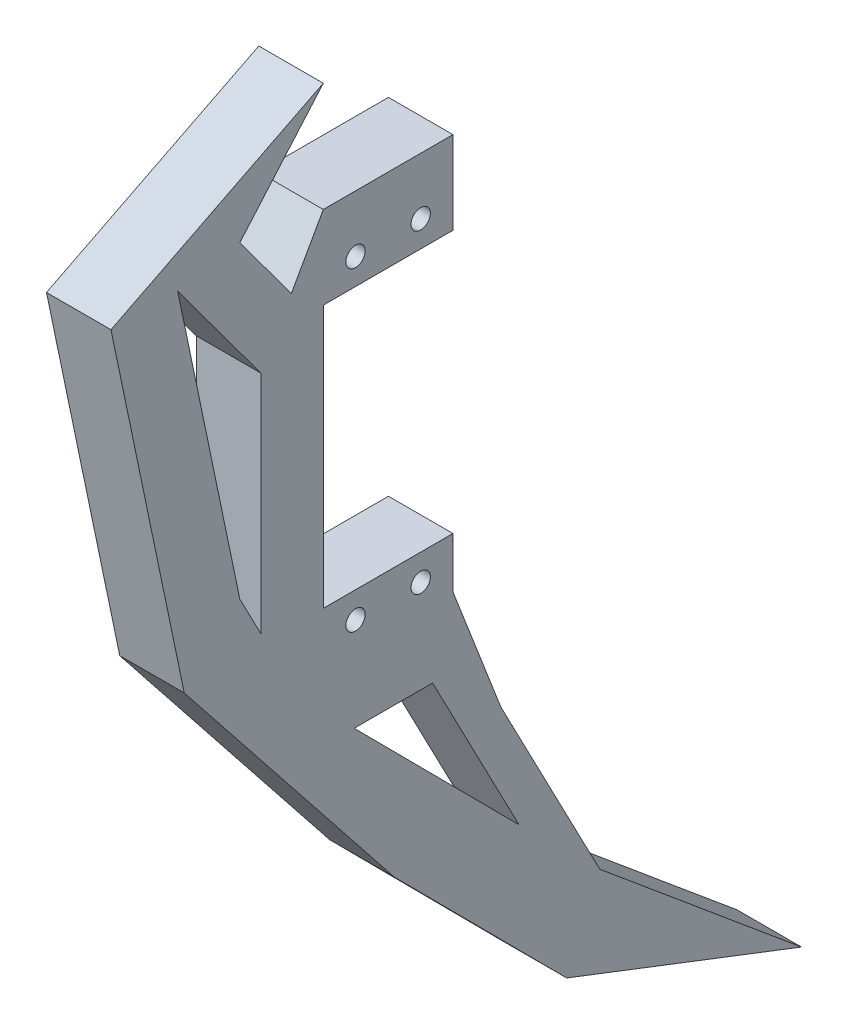
ISO-10303-21;
HEADER;
FILE_DESCRIPTION(('STEP AP214'),'2;1');
FILE_NAME('part.step','',(''),(''),'','','');
FILE_SCHEMA(('AUTOMOTIVE_DESIGN { 1 0 10303 214 1 1 1 1 }'));
ENDSEC;
DATA;
#1=APPLICATION_CONTEXT('core data for automotive mechanical design processes');
#2=APPLICATION_PROTOCOL_DEFINITION('international standard','automotive_design',2000,#1);
#3=PRODUCT_CONTEXT('',#1,'mechanical');
#4=PRODUCT('Part','Part','',(#3));
#5=PRODUCT_RELATED_PRODUCT_CATEGORY('part','',(#4));
#6=PRODUCT_DEFINITION_FORMATION('','',#4);
#7=PRODUCT_DEFINITION_CONTEXT('part definition',#1,'design');
#8=PRODUCT_DEFINITION('design','',#6,#7);
#9=PRODUCT_DEFINITION_SHAPE('','',#8);
#10=(LENGTH_UNIT() NAMED_UNIT(*) SI_UNIT(.MILLI.,.METRE.));
#11=(NAMED_UNIT(*) PLANE_ANGLE_UNIT() SI_UNIT($,.RADIAN.));
#12=(NAMED_UNIT(*) SI_UNIT($,.STERADIAN.) SOLID_ANGLE_UNIT());
#13=UNCERTAINTY_MEASURE_WITH_UNIT(LENGTH_MEASURE(1.E-05),#10,'distance_accuracy_value','');
#14=(GEOMETRIC_REPRESENTATION_CONTEXT(3) GLOBAL_UNCERTAINTY_ASSIGNED_CONTEXT((#13)) GLOBAL_UNIT_ASSIGNED_CONTEXT((#10,
#11,#12)) REPRESENTATION_CONTEXT('',''));
#15=CARTESIAN_POINT('',(0.,0.,0.));
#16=DIRECTION('',(0.,0.,1.));
#17=DIRECTION('',(1.,0.,0.));
#18=AXIS2_PLACEMENT_3D('',#15,#16,#17);
#19=CARTESIAN_POINT('',(10.,-12.4208972994453,23.8424445017058));
#20=DIRECTION('',(0.,-0.462020951263859,0.886869009827967));
#21=DIRECTION('',(0.,-0.886869009827967,-0.462020951263859));
#22=AXIS2_PLACEMENT_3D('',#19,#20,#21);
#23=PLANE('',#22);
#24=DIRECTION('',(0.,0.886869009827967,0.462020951263859));
#25=VECTOR('',#24,1.);
#26=CARTESIAN_POINT('',(0.,-12.4208972994453,23.8424445017058));
#27=LINE('',#26,#25);
#28=CARTESIAN_POINT('',(0.,-144.573005818384,-45.0031710433545));
#29=VERTEX_POINT('',#28);
#30=CARTESIAN_POINT('',(0.,-138.313009894929,-41.7419800000195));
#31=VERTEX_POINT('',#30);
#32=EDGE_CURVE('E302',#29,#31,#27,.T.);
#33=ORIENTED_EDGE('',*,*,#32,.T.);
#34=DIRECTION('',(-1.,0.,0.));
#35=VECTOR('',#34,1.);
#36=CARTESIAN_POINT('',(10.,-138.313009894929,-41.7419800000195));
#37=LINE('',#36,#35);
#38=CARTESIAN_POINT('',(10.,-138.313009894929,-41.7419800000195));
#39=VERTEX_POINT('',#38);
#40=EDGE_CURVE('E11',#39,#31,#37,.T.);
#41=ORIENTED_EDGE('',*,*,#40,.F.);
#42=DIRECTION('',(0.,0.886869009827967,0.462020951263859));
#43=VECTOR('',#42,1.);
#44=CARTESIAN_POINT('',(10.,-12.4208972994453,23.8424445017058));
#45=LINE('',#44,#43);
#46=CARTESIAN_POINT('',(10.,-144.573005818384,-45.0031710433545));
#47=VERTEX_POINT('',#46);
#48=EDGE_CURVE('E216',#47,#39,#45,.T.);
#49=ORIENTED_EDGE('',*,*,#48,.F.);
#50=DIRECTION('',(-1.,0.,0.));
#51=VECTOR('',#50,1.);
#52=CARTESIAN_POINT('',(10.,-144.573005818384,-45.0031710433545));
#53=LINE('',#52,#51);
#54=EDGE_CURVE('E309',#47,#29,#53,.T.);
#55=ORIENTED_EDGE('',*,*,#54,.T.);
#56=EDGE_LOOP('',(#33,#41,#49,#55));
#57=FACE_BOUND('',#56,.T.);
#58=ADVANCED_FACE('F39',(#57),#23,.F.);
#59=CARTESIAN_POINT('',(10.,2.57645491305037,-12.350258236895));
#60=DIRECTION('',(0.,-0.204218947524491,0.97892523793801));
#61=DIRECTION('',(0.,-0.97892523793801,-0.204218947524491));
#62=AXIS2_PLACEMENT_3D('',#59,#60,#61);
#63=PLANE('',#62);
#64=DIRECTION('',(0.,0.97892523793801,0.204218947524491));
#65=VECTOR('',#64,1.);
#66=CARTESIAN_POINT('',(0.,2.57645491305037,-12.350258236895));
#67=LINE('',#66,#65);
#68=CARTESIAN_POINT('',(0.,-92.1478829932747,-32.1112204048854));
#69=VERTEX_POINT('',#68);
#70=EDGE_CURVE('E221',#31,#69,#67,.T.);
#71=ORIENTED_EDGE('',*,*,#70,.T.);
#72=DIRECTION('',(-1.,0.,0.));
#73=VECTOR('',#72,1.);
#74=CARTESIAN_POINT('',(10.,-92.1478829932747,-32.1112204048854));
#75=LINE('',#74,#73);
#76=CARTESIAN_POINT('',(10.,-92.1478829932747,-32.1112204048854));
#77=VERTEX_POINT('',#76);
#78=EDGE_CURVE('E49',#77,#69,#75,.T.);
#79=ORIENTED_EDGE('',*,*,#78,.F.);
#80=DIRECTION('',(0.,0.97892523793801,0.204218947524491));
#81=VECTOR('',#80,1.);
#82=CARTESIAN_POINT('',(10.,2.57645491305037,-12.350258236895));
#83=LINE('',#82,#81);
#84=EDGE_CURVE('E210',#39,#77,#83,.T.);
#85=ORIENTED_EDGE('',*,*,#84,.F.);
#86=ORIENTED_EDGE('',*,*,#40,.T.);
#87=EDGE_LOOP('',(#71,#79,#85,#86));
#88=FACE_BOUND('',#87,.T.);
#89=ADVANCED_FACE('F220',(#88),#63,.F.);
#90=CARTESIAN_POINT('',(10.,-17.2053165137872,23.2787665640437));
#91=DIRECTION('',(0.,0.594374789259821,-0.804188168212106));
#92=DIRECTION('',(0.,0.804188168212106,0.594374789259821));
#93=AXIS2_PLACEMENT_3D('',#90,#91,#92);
#94=PLANE('',#93);
#95=DIRECTION('',(0.,-0.804188168212106,-0.594374789259821));
#96=VECTOR('',#95,1.);
#97=CARTESIAN_POINT('',(0.,-17.2053165137872,23.2787665640437));
#98=LINE('',#97,#96);
#99=CARTESIAN_POINT('',(0.,-109.590672216455,-45.0031710433545));
#100=VERTEX_POINT('',#99);
#101=EDGE_CURVE('E135',#69,#100,#98,.T.);
#102=ORIENTED_EDGE('',*,*,#101,.T.);
#103=DIRECTION('',(-1.,0.,0.));
#104=VECTOR('',#103,1.);
#105=CARTESIAN_POINT('',(10.,-109.590672216455,-45.0031710433545));
#106=LINE('',#105,#104);
#107=CARTESIAN_POINT('',(10.,-109.590672216455,-45.0031710433545));
#108=VERTEX_POINT('',#107);
#109=EDGE_CURVE('E222',#108,#100,#106,.T.);
#110=ORIENTED_EDGE('',*,*,#109,.F.);
#111=DIRECTION('',(0.,-0.804188168212106,-0.594374789259821));
#112=VECTOR('',#111,1.);
#113=CARTESIAN_POINT('',(10.,-17.2053165137872,23.2787665640437));
#114=LINE('',#113,#112);
#115=EDGE_CURVE('E214',#77,#108,#114,.T.);
#116=ORIENTED_EDGE('',*,*,#115,.F.);
#117=ORIENTED_EDGE('',*,*,#78,.T.);
#118=EDGE_LOOP('',(#102,#110,#116,#117));
#119=FACE_BOUND('',#118,.T.);
#120=ADVANCED_FACE('F224',(#119),#94,.F.);
#121=CARTESIAN_POINT('',(10.,-5.76971008354363,11.0752056909741));
#122=DIRECTION('',(0.,-0.462020951263859,0.886869009827967));
#123=DIRECTION('',(0.,-0.886869009827967,-0.462020951263859));
#124=AXIS2_PLACEMENT_3D('',#121,#122,#123);
#125=PLANE('',#124);
#126=DIRECTION('',(0.,0.886869009827967,0.462020951263859));
#127=VECTOR('',#126,1.);
#128=CARTESIAN_POINT('',(0.,-5.76971008354363,11.0752056909741));
#129=LINE('',#128,#127);
#130=CARTESIAN_POINT('',(0.,-190.250468959632,-85.0314061776066));
#131=VERTEX_POINT('',#130);
#132=CARTESIAN_POINT('',(0.,-164.513746490015,-71.623670800617));
#133=VERTEX_POINT('',#132);
#134=EDGE_CURVE('E293',#131,#133,#129,.T.);
#135=ORIENTED_EDGE('',*,*,#134,.F.);
#136=DIRECTION('',(-1.,0.,0.));
#137=VECTOR('',#136,1.);
#138=CARTESIAN_POINT('',(10.,-190.250468959632,-85.0314061776066));
#139=LINE('',#138,#137);
#140=CARTESIAN_POINT('',(10.,-190.250468959632,-85.0314061776066));
#141=VERTEX_POINT('',#140);
#142=EDGE_CURVE('E311',#141,#131,#139,.T.);
#143=ORIENTED_EDGE('',*,*,#142,.F.);
#144=DIRECTION('',(0.,0.886869009827967,0.462020951263859));
#145=VECTOR('',#144,1.);
#146=CARTESIAN_POINT('',(10.,-5.76971008354363,11.0752056909741));
#147=LINE('',#146,#145);
#148=CARTESIAN_POINT('',(10.,-164.513746490015,-71.623670800617));
#149=VERTEX_POINT('',#148);
#150=EDGE_CURVE('E467',#141,#149,#147,.T.);
#151=ORIENTED_EDGE('',*,*,#150,.T.);
#152=DIRECTION('',(-1.,0.,0.));
#153=VECTOR('',#152,1.);
#154=CARTESIAN_POINT('',(10.,-164.513746490015,-71.623670800617));
#155=LINE('',#154,#153);
#156=EDGE_CURVE('E313',#149,#133,#155,.T.);
#157=ORIENTED_EDGE('',*,*,#156,.T.);
#158=EDGE_LOOP('',(#135,#143,#151,#157));
#159=FACE_BOUND('',#158,.T.);
#160=ADVANCED_FACE('F488',(#159),#125,.T.);
#161=CARTESIAN_POINT('',(10.,-51.9481922726194,52.3111827095462));
#162=DIRECTION('',(0.,0.704640640780534,-0.709564350401285));
#163=DIRECTION('',(0.,0.709564350401285,0.704640640780534));
#164=AXIS2_PLACEMENT_3D('',#161,#162,#163);
#165=PLANE('',#164);
#166=DIRECTION('',(0.,-0.709564350401285,-0.704640640780534));
#167=VECTOR('',#166,1.);
#168=CARTESIAN_POINT('',(0.,-51.9481922726194,52.3111827095462));
#169=LINE('',#168,#167);
#170=CARTESIAN_POINT('',(0.,-164.513746490015,-59.4732723701157));
#171=VERTEX_POINT('',#170);
#172=EDGE_CURVE('E296',#171,#131,#169,.T.);
#173=ORIENTED_EDGE('',*,*,#172,.F.);
#174=DIRECTION('',(-1.,0.,0.));
#175=VECTOR('',#174,1.);
#176=CARTESIAN_POINT('',(10.,-164.513746490015,-59.4732723701157));
#177=LINE('',#176,#175);
#178=CARTESIAN_POINT('',(10.,-164.513746490015,-59.4732723701157));
#179=VERTEX_POINT('',#178);
#180=EDGE_CURVE('E315',#179,#171,#177,.T.);
#181=ORIENTED_EDGE('',*,*,#180,.F.);
#182=DIRECTION('',(0.,-0.709564350401285,-0.704640640780534));
#183=VECTOR('',#182,1.);
#184=CARTESIAN_POINT('',(10.,-51.9481922726194,52.3111827095462));
#185=LINE('',#184,#183);
#186=EDGE_CURVE('E470',#179,#141,#185,.T.);
#187=ORIENTED_EDGE('',*,*,#186,.T.);
#188=ORIENTED_EDGE('',*,*,#142,.T.);
#189=EDGE_LOOP('',(#173,#181,#187,#188));
#190=FACE_BOUND('',#189,.T.);
#191=ADVANCED_FACE('F484',(#190),#165,.T.);
#192=CARTESIAN_POINT('',(10.,-105.314484453538,0.));
#193=DIRECTION('',(0.,-1.,0.));
#194=DIRECTION('',(0.,0.,-1.));
#195=AXIS2_PLACEMENT_3D('',#192,#193,#194);
#196=PLANE('',#195);
#197=DIRECTION('',(0.,0.,1.));
#198=VECTOR('',#197,1.);
#199=CARTESIAN_POINT('',(0.,-105.314484453538,0.));
#200=LINE('',#199,#198);
#201=CARTESIAN_POINT('',(0.,-105.314484453538,-74.7812226480717));
#202=VERTEX_POINT('',#201);
#203=CARTESIAN_POINT('',(0.,-105.314484453538,-54.6812226480717));
#204=VERTEX_POINT('',#203);
#205=EDGE_CURVE('E242',#202,#204,#200,.T.);
#206=ORIENTED_EDGE('',*,*,#205,.F.);
#207=DIRECTION('',(-1.,0.,0.));
#208=VECTOR('',#207,1.);
#209=CARTESIAN_POINT('',(10.,-105.314484453538,-74.7812226480717));
#210=LINE('',#209,#208);
#211=CARTESIAN_POINT('',(10.,-105.314484453538,-74.7812226480717));
#212=VERTEX_POINT('',#211);
#213=EDGE_CURVE('E43',#212,#202,#210,.T.);
#214=ORIENTED_EDGE('',*,*,#213,.F.);
#215=DIRECTION('',(0.,0.,1.));
#216=VECTOR('',#215,1.);
#217=CARTESIAN_POINT('',(10.,-105.314484453538,0.));
#218=LINE('',#217,#216);
#219=CARTESIAN_POINT('',(10.,-105.314484453538,-54.6812226480717));
#220=VERTEX_POINT('',#219);
#221=EDGE_CURVE('E368',#212,#220,#218,.T.);
#222=ORIENTED_EDGE('',*,*,#221,.T.);
#223=DIRECTION('',(-1.,0.,0.));
#224=VECTOR('',#223,1.);
#225=CARTESIAN_POINT('',(10.,-105.314484453538,-54.6812226480717));
#226=LINE('',#225,#224);
#227=EDGE_CURVE('E226',#220,#204,#226,.T.);
#228=ORIENTED_EDGE('',*,*,#227,.T.);
#229=EDGE_LOOP('',(#206,#214,#222,#228));
#230=FACE_BOUND('',#229,.T.);
#231=ADVANCED_FACE('F367',(#230),#196,.T.);
#232=CARTESIAN_POINT('',(10.,0.,-74.7812226480717));
#233=DIRECTION('',(0.,0.,1.));
#234=DIRECTION('',(1.,0.,0.));
#235=AXIS2_PLACEMENT_3D('',#232,#233,#234);
#236=PLANE('',#235);
#237=DIRECTION('',(0.,1.,0.));
#238=VECTOR('',#237,1.);
#239=CARTESIAN_POINT('',(0.,0.,-74.7812226480717));
#240=LINE('',#239,#238);
#241=CARTESIAN_POINT('',(0.,-92.4644844535385,-74.7812226480717));
#242=VERTEX_POINT('',#241);
#243=EDGE_CURVE('E245',#202,#242,#240,.T.);
#244=ORIENTED_EDGE('',*,*,#243,.T.);
#245=DIRECTION('',(-1.,0.,0.));
#246=VECTOR('',#245,1.);
#247=CARTESIAN_POINT('',(10.,-92.4644844535385,-74.7812226480717));
#248=LINE('',#247,#246);
#249=CARTESIAN_POINT('',(10.,-92.4644844535385,-74.7812226480717));
#250=VERTEX_POINT('',#249);
#251=EDGE_CURVE('E352',#250,#242,#248,.T.);
#252=ORIENTED_EDGE('',*,*,#251,.F.);
#253=DIRECTION('',(0.,1.,0.));
#254=VECTOR('',#253,1.);
#255=CARTESIAN_POINT('',(10.,0.,-74.7812226480717));
#256=LINE('',#255,#254);
#257=EDGE_CURVE('E360',#212,#250,#256,.T.);
#258=ORIENTED_EDGE('',*,*,#257,.F.);
#259=ORIENTED_EDGE('',*,*,#213,.T.);
#260=EDGE_LOOP('',(#244,#252,#258,#259));
#261=FACE_BOUND('',#260,.T.);
#262=ADVANCED_FACE('F359',(#261),#236,.F.);
#263=CARTESIAN_POINT('',(10.,-92.4644844535385,0.));
#264=DIRECTION('',(0.,1.,0.));
#265=DIRECTION('',(0.,0.,1.));
#266=AXIS2_PLACEMENT_3D('',#263,#264,#265);
#267=PLANE('',#266);
#268=DIRECTION('',(0.,0.,-1.));
#269=VECTOR('',#268,1.);
#270=CARTESIAN_POINT('',(0.,-92.4644844535385,0.));
#271=LINE('',#270,#269);
#272=CARTESIAN_POINT('',(0.,-92.4644844535385,-54.6812226480717));
#273=VERTEX_POINT('',#272);
#274=EDGE_CURVE('E248',#273,#242,#271,.T.);
#275=ORIENTED_EDGE('',*,*,#274,.F.);
#276=DIRECTION('',(-1.,0.,0.));
#277=VECTOR('',#276,1.);
#278=CARTESIAN_POINT('',(10.,-92.4644844535385,-54.6812226480717));
#279=LINE('',#278,#277);
#280=CARTESIAN_POINT('',(10.,-92.4644844535385,-54.6812226480717));
#281=VERTEX_POINT('',#280);
#282=EDGE_CURVE('E351',#281,#273,#279,.T.);
#283=ORIENTED_EDGE('',*,*,#282,.F.);
#284=DIRECTION('',(0.,0.,-1.));
#285=VECTOR('',#284,1.);
#286=CARTESIAN_POINT('',(10.,-92.4644844535385,0.));
#287=LINE('',#286,#285);
#288=EDGE_CURVE('E443',#281,#250,#287,.T.);
#289=ORIENTED_EDGE('',*,*,#288,.T.);
#290=ORIENTED_EDGE('',*,*,#251,.T.);
#291=EDGE_LOOP('',(#275,#283,#289,#290));
#292=FACE_BOUND('',#291,.T.);
#293=ADVANCED_FACE('F442',(#292),#267,.T.);
#294=CARTESIAN_POINT('',(10.,-45.5896715194629,-81.0483049234893));
#295=DIRECTION('',(0.,-0.49026123963256,-0.871575537124549));
#296=DIRECTION('',(0.,0.871575537124549,-0.49026123963256));
#297=AXIS2_PLACEMENT_3D('',#294,#295,#296);
#298=PLANE('',#297);
#299=DIRECTION('',(0.,-0.871575537124549,0.49026123963256));
#300=VECTOR('',#299,1.);
#301=CARTESIAN_POINT('',(0.,-45.5896715194629,-81.0483049234893));
#302=LINE('',#301,#300);
#303=CARTESIAN_POINT('',(0.,-101.264484453538,-49.7312226480717));
#304=VERTEX_POINT('',#303);
#305=EDGE_CURVE('E251',#273,#304,#302,.T.);
#306=ORIENTED_EDGE('',*,*,#305,.T.);
#307=DIRECTION('',(-1.,0.,0.));
#308=VECTOR('',#307,1.);
#309=CARTESIAN_POINT('',(10.,-101.264484453538,-49.7312226480717));
#310=LINE('',#309,#308);
#311=CARTESIAN_POINT('',(10.,-101.264484453538,-49.7312226480717));
#312=VERTEX_POINT('',#311);
#313=EDGE_CURVE('E348',#312,#304,#310,.T.);
#314=ORIENTED_EDGE('',*,*,#313,.F.);
#315=DIRECTION('',(0.,-0.871575537124549,0.49026123963256));
#316=VECTOR('',#315,1.);
#317=CARTESIAN_POINT('',(10.,-45.5896715194629,-81.0483049234893));
#318=LINE('',#317,#316);
#319=EDGE_CURVE('E440',#281,#312,#318,.T.);
#320=ORIENTED_EDGE('',*,*,#319,.F.);
#321=ORIENTED_EDGE('',*,*,#282,.T.);
#322=EDGE_LOOP('',(#306,#314,#320,#321));
#323=FACE_BOUND('',#322,.T.);
#324=ADVANCED_FACE('F439',(#323),#298,.F.);
#325=CARTESIAN_POINT('',(10.,-12.0038718501367,16.2412199996499));
#326=DIRECTION('',(0.,-0.594374789259821,0.804188168212106));
#327=DIRECTION('',(0.,-0.804188168212106,-0.594374789259821));
#328=AXIS2_PLACEMENT_3D('',#325,#326,#327);
#329=PLANE('',#328);
#330=DIRECTION('',(0.,0.804188168212106,0.594374789259821));
#331=VECTOR('',#330,1.);
#332=CARTESIAN_POINT('',(0.,-12.0038718501367,16.2412199996499));
#333=LINE('',#332,#331);
#334=CARTESIAN_POINT('',(0.,-90.4550515390972,-41.7419800000195));
#335=VERTEX_POINT('',#334);
#336=EDGE_CURVE('E254',#304,#335,#333,.T.);
#337=ORIENTED_EDGE('',*,*,#336,.T.);
#338=DIRECTION('',(-1.,0.,0.));
#339=VECTOR('',#338,1.);
#340=CARTESIAN_POINT('',(10.,-90.4550515390972,-41.7419800000195));
#341=LINE('',#340,#339);
#342=CARTESIAN_POINT('',(10.,-90.4550515390972,-41.7419800000195));
#343=VERTEX_POINT('',#342);
#344=EDGE_CURVE('E345',#343,#335,#341,.T.);
#345=ORIENTED_EDGE('',*,*,#344,.F.);
#346=DIRECTION('',(0.,0.804188168212106,0.594374789259821));
#347=VECTOR('',#346,1.);
#348=CARTESIAN_POINT('',(10.,-12.0038718501367,16.2412199996499));
#349=LINE('',#348,#347);
#350=EDGE_CURVE('E435',#312,#343,#349,.T.);
#351=ORIENTED_EDGE('',*,*,#350,.F.);
#352=ORIENTED_EDGE('',*,*,#313,.T.);
#353=EDGE_LOOP('',(#337,#345,#351,#352));
#354=FACE_BOUND('',#353,.T.);
#355=ADVANCED_FACE('F433',(#354),#329,.F.);
#356=CARTESIAN_POINT('',(10.,-59.4339462602653,-68.6130566462771));
#357=DIRECTION('',(0.,0.654737365870085,0.755856455772855));
#358=DIRECTION('',(0.,-0.755856455772855,0.654737365870085));
#359=AXIS2_PLACEMENT_3D('',#356,#357,#358);
#360=PLANE('',#359);
#361=DIRECTION('',(0.,0.755856455772855,-0.654737365870085));
#362=VECTOR('',#361,1.);
#363=CARTESIAN_POINT('',(0.,-59.4339462602653,-68.6130566462771));
#364=LINE('',#363,#362);
#365=CARTESIAN_POINT('',(0.,-75.5174435787746,-54.6812226480717));
#366=VERTEX_POINT('',#365);
#367=EDGE_CURVE('E257',#335,#366,#364,.T.);
#368=ORIENTED_EDGE('',*,*,#367,.T.);
#369=DIRECTION('',(-1.,0.,0.));
#370=VECTOR('',#369,1.);
#371=CARTESIAN_POINT('',(10.,-75.5174435787746,-54.6812226480717));
#372=LINE('',#371,#370);
#373=CARTESIAN_POINT('',(10.,-75.5174435787746,-54.6812226480717));
#374=VERTEX_POINT('',#373);
#375=EDGE_CURVE('E342',#374,#366,#372,.T.);
#376=ORIENTED_EDGE('',*,*,#375,.F.);
#377=DIRECTION('',(0.,0.755856455772855,-0.654737365870085));
#378=VECTOR('',#377,1.);
#379=CARTESIAN_POINT('',(10.,-59.4339462602653,-68.6130566462771));
#380=LINE('',#379,#378);
#381=EDGE_CURVE('E451',#343,#374,#380,.T.);
#382=ORIENTED_EDGE('',*,*,#381,.F.);
#383=ORIENTED_EDGE('',*,*,#344,.T.);
#384=EDGE_LOOP('',(#368,#376,#382,#383));
#385=FACE_BOUND('',#384,.T.);
#386=ADVANCED_FACE('F429',(#385),#360,.F.);
#387=CARTESIAN_POINT('',(10.,-82.1677883921624,-41.5203469425383));
#388=DIRECTION('',(0.,-0.892522815353456,-0.451002243978387));
#389=DIRECTION('',(0.,0.451002243978387,-0.892522815353456));
#390=AXIS2_PLACEMENT_3D('',#387,#388,#389);
#391=PLANE('',#390);
#392=DIRECTION('',(0.,-0.451002243978387,0.892522815353456));
#393=VECTOR('',#392,1.);
#394=CARTESIAN_POINT('',(0.,-82.1677883921624,-41.5203469425383));
#395=LINE('',#394,#393);
#396=CARTESIAN_POINT('',(0.,-92.147882993275,-21.7699748550202));
#397=VERTEX_POINT('',#396);
#398=EDGE_CURVE('E260',#366,#397,#395,.T.);
#399=ORIENTED_EDGE('',*,*,#398,.T.);
#400=DIRECTION('',(-1.,0.,0.));
#401=VECTOR('',#400,1.);
#402=CARTESIAN_POINT('',(10.,-92.147882993275,-21.7699748550202));
#403=LINE('',#402,#401);
#404=CARTESIAN_POINT('',(10.,-92.147882993275,-21.7699748550202));
#405=VERTEX_POINT('',#404);
#406=EDGE_CURVE('E339',#405,#397,#403,.T.);
#407=ORIENTED_EDGE('',*,*,#406,.F.);
#408=DIRECTION('',(0.,-0.451002243978387,0.892522815353456));
#409=VECTOR('',#408,1.);
#410=CARTESIAN_POINT('',(10.,-82.1677883921624,-41.5203469425383));
#411=LINE('',#410,#409);
#412=EDGE_CURVE('E426',#374,#405,#411,.T.);
#413=ORIENTED_EDGE('',*,*,#412,.F.);
#414=ORIENTED_EDGE('',*,*,#375,.T.);
#415=EDGE_LOOP('',(#399,#407,#413,#414));
#416=FACE_BOUND('',#415,.T.);
#417=ADVANCED_FACE('F424',(#416),#391,.F.);
#418=CARTESIAN_POINT('',(10.,0.509083963067611,-2.44029824713801));
#419=DIRECTION('',(0.,0.204218947524491,-0.97892523793801));
#420=DIRECTION('',(0.,0.97892523793801,0.204218947524491));
#421=AXIS2_PLACEMENT_3D('',#418,#419,#420);
#422=PLANE('',#421);
#423=DIRECTION('',(0.,-0.97892523793801,-0.204218947524491));
#424=VECTOR('',#423,1.);
#425=CARTESIAN_POINT('',(0.,0.509083963067611,-2.44029824713801));
#426=LINE('',#425,#424);
#427=CARTESIAN_POINT('',(0.,-146.599083723117,-33.1293376271111));
#428=VERTEX_POINT('',#427);
#429=EDGE_CURVE('E263',#397,#428,#426,.T.);
#430=ORIENTED_EDGE('',*,*,#429,.T.);
#431=DIRECTION('',(-1.,0.,0.));
#432=VECTOR('',#431,1.);
#433=CARTESIAN_POINT('',(10.,-146.599083723117,-33.1293376271111));
#434=LINE('',#433,#432);
#435=CARTESIAN_POINT('',(10.,-146.599083723117,-33.1293376271111));
#436=VERTEX_POINT('',#435);
#437=EDGE_CURVE('E337',#436,#428,#434,.T.);
#438=ORIENTED_EDGE('',*,*,#437,.F.);
#439=DIRECTION('',(0.,-0.97892523793801,-0.204218947524491));
#440=VECTOR('',#439,1.);
#441=CARTESIAN_POINT('',(10.,0.509083963067611,-2.44029824713801));
#442=LINE('',#441,#440);
#443=EDGE_CURVE('E421',#405,#436,#442,.T.);
#444=ORIENTED_EDGE('',*,*,#443,.F.);
#445=ORIENTED_EDGE('',*,*,#406,.T.);
#446=EDGE_LOOP('',(#430,#438,#444,#445));
#447=FACE_BOUND('',#446,.T.);
#448=ADVANCED_FACE('F420',(#447),#422,.F.);
#449=CARTESIAN_POINT('',(10.,-40.5639532747082,51.0784559656091));
#450=DIRECTION('',(0.,-0.621897657028147,0.783098527761929));
#451=DIRECTION('',(0.,-0.783098527761929,-0.621897657028147));
#452=AXIS2_PLACEMENT_3D('',#449,#450,#451);
#453=PLANE('',#452);
#454=DIRECTION('',(0.,0.783098527761929,0.621897657028147));
#455=VECTOR('',#454,1.);
#456=CARTESIAN_POINT('',(0.,-40.5639532747082,51.0784559656091));
#457=LINE('',#456,#455);
#458=CARTESIAN_POINT('',(0.,-187.583359254815,-65.6769980102848));
#459=VERTEX_POINT('',#458);
#460=EDGE_CURVE('E266',#459,#428,#457,.T.);
#461=ORIENTED_EDGE('',*,*,#460,.F.);
#462=DIRECTION('',(-1.,0.,0.));
#463=VECTOR('',#462,1.);
#464=CARTESIAN_POINT('',(10.,-187.583359254815,-65.6769980102848));
#465=LINE('',#464,#463);
#466=CARTESIAN_POINT('',(10.,-187.583359254815,-65.6769980102848));
#467=VERTEX_POINT('',#466);
#468=EDGE_CURVE('E335',#467,#459,#465,.T.);
#469=ORIENTED_EDGE('',*,*,#468,.F.);
#470=DIRECTION('',(0.,0.783098527761929,0.621897657028147));
#471=VECTOR('',#470,1.);
#472=CARTESIAN_POINT('',(10.,-40.5639532747082,51.0784559656091));
#473=LINE('',#472,#471);
#474=EDGE_CURVE('E455',#467,#436,#473,.T.);
#475=ORIENTED_EDGE('',*,*,#474,.T.);
#476=ORIENTED_EDGE('',*,*,#437,.T.);
#477=EDGE_LOOP('',(#461,#469,#475,#476));
#478=FACE_BOUND('',#477,.T.);
#479=ADVANCED_FACE('F416',(#478),#453,.T.);
#480=CARTESIAN_POINT('',(10.,-60.3008926223167,60.7222479458124));
#481=DIRECTION('',(0.,-0.704640640780534,0.709564350401285));
#482=DIRECTION('',(0.,-0.709564350401285,-0.704640640780534));
#483=AXIS2_PLACEMENT_3D('',#480,#481,#482);
#484=PLANE('',#483);
#485=DIRECTION('',(0.,0.709564350401285,0.704640640780534));
#486=VECTOR('',#485,1.);
#487=CARTESIAN_POINT('',(0.,-60.3008926223167,60.7222479458124));
#488=LINE('',#487,#486);
#489=CARTESIAN_POINT('',(0.,-214.512376165259,-92.4191528559085));
#490=VERTEX_POINT('',#489);
#491=EDGE_CURVE('E269',#490,#459,#488,.T.);
#492=ORIENTED_EDGE('',*,*,#491,.F.);
#493=DIRECTION('',(-1.,0.,0.));
#494=VECTOR('',#493,1.);
#495=CARTESIAN_POINT('',(10.,-214.512376165259,-92.4191528559085));
#496=LINE('',#495,#494);
#497=CARTESIAN_POINT('',(10.,-214.512376165259,-92.4191528559085));
#498=VERTEX_POINT('',#497);
#499=EDGE_CURVE('E333',#498,#490,#496,.T.);
#500=ORIENTED_EDGE('',*,*,#499,.F.);
#501=DIRECTION('',(0.,0.709564350401285,0.704640640780534));
#502=VECTOR('',#501,1.);
#503=CARTESIAN_POINT('',(10.,-60.3008926223167,60.7222479458124));
#504=LINE('',#503,#502);
#505=EDGE_CURVE('E412',#498,#467,#504,.T.);
#506=ORIENTED_EDGE('',*,*,#505,.T.);
#507=ORIENTED_EDGE('',*,*,#468,.T.);
#508=EDGE_LOOP('',(#492,#500,#506,#507));
#509=FACE_BOUND('',#508,.T.);
#510=ADVANCED_FACE('F410',(#509),#484,.T.);
#511=CARTESIAN_POINT('',(10.,-155.676115153272,60.0670696338265));
#512=DIRECTION('',(0.,-0.932960265059771,0.359979365824768));
#513=DIRECTION('',(0.,-0.359979365824768,-0.932960265059771));
#514=AXIS2_PLACEMENT_3D('',#511,#512,#513);
#515=PLANE('',#514);
#516=DIRECTION('',(0.,0.359979365824768,0.932960265059771));
#517=VECTOR('',#516,1.);
#518=CARTESIAN_POINT('',(0.,-155.676115153272,60.0670696338265));
#519=LINE('',#518,#517);
#520=CARTESIAN_POINT('',(0.,-228.557286651536,-128.819415354277));
#521=VERTEX_POINT('',#520);
#522=EDGE_CURVE('E272',#521,#490,#519,.T.);
#523=ORIENTED_EDGE('',*,*,#522,.F.);
#524=DIRECTION('',(-1.,0.,0.));
#525=VECTOR('',#524,1.);
#526=CARTESIAN_POINT('',(10.,-228.557286651536,-128.819415354277));
#527=LINE('',#526,#525);
#528=CARTESIAN_POINT('',(10.,-228.557286651536,-128.819415354277));
#529=VERTEX_POINT('',#528);
#530=EDGE_CURVE('E331',#529,#521,#527,.T.);
#531=ORIENTED_EDGE('',*,*,#530,.F.);
#532=DIRECTION('',(0.,0.359979365824768,0.932960265059771));
#533=VECTOR('',#532,1.);
#534=CARTESIAN_POINT('',(10.,-155.676115153272,60.0670696338265));
#535=LINE('',#534,#533);
#536=EDGE_CURVE('E406',#529,#498,#535,.T.);
#537=ORIENTED_EDGE('',*,*,#536,.T.);
#538=ORIENTED_EDGE('',*,*,#499,.T.);
#539=EDGE_LOOP('',(#523,#531,#537,#538));
#540=FACE_BOUND('',#539,.T.);
#541=ADVANCED_FACE('F403',(#540),#515,.T.);
#542=CARTESIAN_POINT('',(10.,-71.4206754035229,59.5717963829768));
#543=DIRECTION('',(0.,0.767932652463141,-0.640530593555784));
#544=DIRECTION('',(0.,0.640530593555784,0.767932652463141));
#545=AXIS2_PLACEMENT_3D('',#542,#543,#544);
#546=PLANE('',#545);
#547=DIRECTION('',(0.,-0.640530593555784,-0.767932652463141));
#548=VECTOR('',#547,1.);
#549=CARTESIAN_POINT('',(0.,-71.4206754035229,59.5717963829768));
#550=LINE('',#549,#548);
#551=CARTESIAN_POINT('',(0.,-202.471417533068,-97.545045534177));
#552=VERTEX_POINT('',#551);
#553=EDGE_CURVE('E275',#552,#521,#550,.T.);
#554=ORIENTED_EDGE('',*,*,#553,.F.);
#555=DIRECTION('',(-1.,0.,0.));
#556=VECTOR('',#555,1.);
#557=CARTESIAN_POINT('',(10.,-202.471417533068,-97.545045534177));
#558=LINE('',#557,#556);
#559=CARTESIAN_POINT('',(10.,-202.471417533068,-97.545045534177));
#560=VERTEX_POINT('',#559);
#561=EDGE_CURVE('E329',#560,#552,#558,.T.);
#562=ORIENTED_EDGE('',*,*,#561,.F.);
#563=DIRECTION('',(0.,-0.640530593555784,-0.767932652463141));
#564=VECTOR('',#563,1.);
#565=CARTESIAN_POINT('',(10.,-71.4206754035229,59.5717963829768));
#566=LINE('',#565,#564);
#567=EDGE_CURVE('E459',#560,#529,#566,.T.);
#568=ORIENTED_EDGE('',*,*,#567,.T.);
#569=ORIENTED_EDGE('',*,*,#530,.T.);
#570=EDGE_LOOP('',(#554,#562,#568,#569));
#571=FACE_BOUND('',#570,.T.);
#572=ADVANCED_FACE('F399',(#571),#546,.T.);
#573=CARTESIAN_POINT('',(10.,-3.25094527207667,6.24032872657539));
#574=DIRECTION('',(0.,0.462020951263859,-0.886869009827967));
#575=DIRECTION('',(0.,0.886869009827967,0.462020951263859));
#576=AXIS2_PLACEMENT_3D('',#573,#574,#575);
#577=PLANE('',#576);
#578=DIRECTION('',(0.,-0.886869009827967,-0.462020951263859));
#579=VECTOR('',#578,1.);
#580=CARTESIAN_POINT('',(0.,-3.25094527207667,6.24032872657539));
#581=LINE('',#580,#579);
#582=CARTESIAN_POINT('',(0.,-173.050276705936,-82.2178852415241));
#583=VERTEX_POINT('',#582);
#584=EDGE_CURVE('E278',#583,#552,#581,.T.);
#585=ORIENTED_EDGE('',*,*,#584,.F.);
#586=DIRECTION('',(-1.,0.,0.));
#587=VECTOR('',#586,1.);
#588=CARTESIAN_POINT('',(10.,-173.050276705936,-82.2178852415241));
#589=LINE('',#588,#587);
#590=CARTESIAN_POINT('',(10.,-173.050276705936,-82.2178852415241));
#591=VERTEX_POINT('',#590);
#592=EDGE_CURVE('E327',#591,#583,#589,.T.);
#593=ORIENTED_EDGE('',*,*,#592,.F.);
#594=DIRECTION('',(0.,-0.886869009827967,-0.462020951263859));
#595=VECTOR('',#594,1.);
#596=CARTESIAN_POINT('',(10.,-3.25094527207667,6.24032872657539));
#597=LINE('',#596,#595);
#598=EDGE_CURVE('E395',#591,#560,#597,.T.);
#599=ORIENTED_EDGE('',*,*,#598,.T.);
#600=ORIENTED_EDGE('',*,*,#561,.T.);
#601=EDGE_LOOP('',(#585,#593,#599,#600));
#602=FACE_BOUND('',#601,.T.);
#603=ADVANCED_FACE('F391',(#602),#577,.T.);
#604=CARTESIAN_POINT('',(10.,5.10238174336336,-13.1635979030143));
#605=DIRECTION('',(0.,-0.361412676861691,0.93240596148012));
#606=DIRECTION('',(0.,-0.93240596148012,-0.361412676861691));
#607=AXIS2_PLACEMENT_3D('',#604,#605,#606);
#608=PLANE('',#607);
#609=DIRECTION('',(0.,0.93240596148012,0.361412676861691));
#610=VECTOR('',#609,1.);
#611=CARTESIAN_POINT('',(0.,5.10238174336336,-13.1635979030143));
#612=LINE('',#611,#610);
#613=CARTESIAN_POINT('',(0.,-153.864484453538,-74.7812226480717));
#614=VERTEX_POINT('',#613);
#615=EDGE_CURVE('E281',#583,#614,#612,.T.);
#616=ORIENTED_EDGE('',*,*,#615,.T.);
#617=DIRECTION('',(-1.,0.,0.));
#618=VECTOR('',#617,1.);
#619=CARTESIAN_POINT('',(10.,-153.864484453538,-74.7812226480717));
#620=LINE('',#619,#618);
#621=CARTESIAN_POINT('',(10.,-153.864484453538,-74.7812226480717));
#622=VERTEX_POINT('',#621);
#623=EDGE_CURVE('E324',#622,#614,#620,.T.);
#624=ORIENTED_EDGE('',*,*,#623,.F.);
#625=DIRECTION('',(0.,0.93240596148012,0.361412676861691));
#626=VECTOR('',#625,1.);
#627=CARTESIAN_POINT('',(10.,5.10238174336336,-13.1635979030143));
#628=LINE('',#627,#626);
#629=EDGE_CURVE('E462',#591,#622,#628,.T.);
#630=ORIENTED_EDGE('',*,*,#629,.F.);
#631=ORIENTED_EDGE('',*,*,#592,.T.);
#632=EDGE_LOOP('',(#616,#624,#630,#631));
#633=FACE_BOUND('',#632,.T.);
#634=ADVANCED_FACE('F388',(#633),#608,.F.);
#635=CARTESIAN_POINT('',(10.,0.,-74.7812226480717));
#636=DIRECTION('',(0.,0.,1.));
#637=DIRECTION('',(1.,0.,0.));
#638=AXIS2_PLACEMENT_3D('',#635,#636,#637);
#639=PLANE('',#638);
#640=DIRECTION('',(0.,1.,0.));
#641=VECTOR('',#640,1.);
#642=CARTESIAN_POINT('',(0.,0.,-74.7812226480717));
#643=LINE('',#642,#641);
#644=CARTESIAN_POINT('',(0.,-146.014484453538,-74.7812226480717));
#645=VERTEX_POINT('',#644);
#646=EDGE_CURVE('E284',#614,#645,#643,.T.);
#647=ORIENTED_EDGE('',*,*,#646,.T.);
#648=DIRECTION('',(-1.,0.,0.));
#649=VECTOR('',#648,1.);
#650=CARTESIAN_POINT('',(10.,-146.014484453538,-74.7812226480717));
#651=LINE('',#650,#649);
#652=CARTESIAN_POINT('',(10.,-146.014484453538,-74.7812226480717));
#653=VERTEX_POINT('',#652);
#654=EDGE_CURVE('E321',#653,#645,#651,.T.);
#655=ORIENTED_EDGE('',*,*,#654,.F.);
#656=DIRECTION('',(0.,1.,0.));
#657=VECTOR('',#656,1.);
#658=CARTESIAN_POINT('',(10.,0.,-74.7812226480717));
#659=LINE('',#658,#657);
#660=EDGE_CURVE('E384',#622,#653,#659,.T.);
#661=ORIENTED_EDGE('',*,*,#660,.F.);
#662=ORIENTED_EDGE('',*,*,#623,.T.);
#663=EDGE_LOOP('',(#647,#655,#661,#662));
#664=FACE_BOUND('',#663,.T.);
#665=ADVANCED_FACE('F382',(#664),#639,.F.);
#666=CARTESIAN_POINT('',(10.,-146.014484453538,0.));
#667=DIRECTION('',(0.,-1.,0.));
#668=DIRECTION('',(0.,0.,-1.));
#669=AXIS2_PLACEMENT_3D('',#666,#667,#668);
#670=PLANE('',#669);
#671=DIRECTION('',(0.,0.,1.));
#672=VECTOR('',#671,1.);
#673=CARTESIAN_POINT('',(0.,-146.014484453538,0.));
#674=LINE('',#673,#672);
#675=CARTESIAN_POINT('',(0.,-146.014484453538,-54.6812226480717));
#676=VERTEX_POINT('',#675);
#677=EDGE_CURVE('E287',#645,#676,#674,.T.);
#678=ORIENTED_EDGE('',*,*,#677,.T.);
#679=DIRECTION('',(-1.,0.,0.));
#680=VECTOR('',#679,1.);
#681=CARTESIAN_POINT('',(10.,-146.014484453538,-54.6812226480717));
#682=LINE('',#681,#680);
#683=CARTESIAN_POINT('',(10.,-146.014484453538,-54.6812226480717));
#684=VERTEX_POINT('',#683);
#685=EDGE_CURVE('E319',#684,#676,#682,.T.);
#686=ORIENTED_EDGE('',*,*,#685,.F.);
#687=DIRECTION('',(0.,0.,1.));
#688=VECTOR('',#687,1.);
#689=CARTESIAN_POINT('',(10.,-146.014484453538,0.));
#690=LINE('',#689,#688);
#691=EDGE_CURVE('E379',#653,#684,#690,.T.);
#692=ORIENTED_EDGE('',*,*,#691,.F.);
#693=ORIENTED_EDGE('',*,*,#654,.T.);
#694=EDGE_LOOP('',(#678,#686,#692,#693));
#695=FACE_BOUND('',#694,.T.);
#696=ADVANCED_FACE('F378',(#695),#670,.F.);
#697=CARTESIAN_POINT('',(10.,-164.513746490015,0.));
#698=DIRECTION('',(0.,-1.,0.));
#699=DIRECTION('',(0.,0.,-1.));
#700=AXIS2_PLACEMENT_3D('',#697,#698,#699);
#701=PLANE('',#700);
#702=DIRECTION('',(0.,0.,1.));
#703=VECTOR('',#702,1.);
#704=CARTESIAN_POINT('',(0.,-164.513746490015,0.));
#705=LINE('',#704,#703);
#706=EDGE_CURVE('E299',#133,#171,#705,.T.);
#707=ORIENTED_EDGE('',*,*,#706,.F.);
#708=ORIENTED_EDGE('',*,*,#156,.F.);
#709=DIRECTION('',(0.,0.,1.));
#710=VECTOR('',#709,1.);
#711=CARTESIAN_POINT('',(10.,-164.513746490015,0.));
#712=LINE('',#711,#710);
#713=EDGE_CURVE('E473',#149,#179,#712,.T.);
#714=ORIENTED_EDGE('',*,*,#713,.T.);
#715=ORIENTED_EDGE('',*,*,#180,.T.);
#716=EDGE_LOOP('',(#707,#708,#714,#715));
#717=FACE_BOUND('',#716,.T.);
#718=ADVANCED_FACE('F478',(#717),#701,.T.);
#719=CARTESIAN_POINT('',(10.,0.,-54.6812226480717));
#720=DIRECTION('',(0.,0.,-1.));
#721=DIRECTION('',(-1.,0.,0.));
#722=AXIS2_PLACEMENT_3D('',#719,#720,#721);
#723=PLANE('',#722);
#724=DIRECTION('',(0.,-1.,0.));
#725=VECTOR('',#724,1.);
#726=CARTESIAN_POINT('',(0.,0.,-54.6812226480717));
#727=LINE('',#726,#725);
#728=EDGE_CURVE('E290',#204,#676,#727,.T.);
#729=ORIENTED_EDGE('',*,*,#728,.F.);
#730=ORIENTED_EDGE('',*,*,#227,.F.);
#731=DIRECTION('',(0.,-1.,0.));
#732=VECTOR('',#731,1.);
#733=CARTESIAN_POINT('',(10.,0.,-54.6812226480717));
#734=LINE('',#733,#732);
#735=EDGE_CURVE('E373',#220,#684,#734,.T.);
#736=ORIENTED_EDGE('',*,*,#735,.T.);
#737=ORIENTED_EDGE('',*,*,#685,.T.);
#738=EDGE_LOOP('',(#729,#730,#736,#737));
#739=FACE_BOUND('',#738,.T.);
#740=ADVANCED_FACE('F372',(#739),#723,.T.);
#741=CARTESIAN_POINT('',(10.,-101.264484453538,-59.6812226480717));
#742=DIRECTION('',(-1.,0.,0.));
#743=DIRECTION('',(0.,0.,1.));
#744=AXIS2_PLACEMENT_3D('',#741,#742,#743);
#745=CYLINDRICAL_SURFACE('',#744,1.5);
#746=CARTESIAN_POINT('',(10.,-101.264484453538,-59.6812226480717));
#747=DIRECTION('',(1.,0.,0.));
#748=DIRECTION('',(0.,0.,-1.));
#749=AXIS2_PLACEMENT_3D('',#746,#747,#748);
#750=CIRCLE('',#749,1.5);
#751=CARTESIAN_POINT('',(10.,-101.264484453538,-61.1812226480717));
#752=VERTEX_POINT('',#751);
#753=EDGE_CURVE('E831',#752,#752,#750,.T.);
#754=ORIENTED_EDGE('',*,*,#753,.T.);
#755=EDGE_LOOP('',(#754));
#756=FACE_BOUND('',#755,.T.);
#757=CARTESIAN_POINT('',(0.,-101.264484453538,-59.6812226480717));
#758=DIRECTION('',(1.,0.,0.));
#759=DIRECTION('',(0.,0.,-1.));
#760=AXIS2_PLACEMENT_3D('',#757,#758,#759);
#761=CIRCLE('',#760,1.5);
#762=CARTESIAN_POINT('',(0.,-101.264484453538,-61.1812226480717));
#763=VERTEX_POINT('',#762);
#764=EDGE_CURVE('E239',#763,#763,#761,.T.);
#765=ORIENTED_EDGE('',*,*,#764,.F.);
#766=EDGE_LOOP('',(#765));
#767=FACE_BOUND('',#766,.T.);
#768=ADVANCED_FACE('F511',(#756,#767),#745,.F.);
#769=CARTESIAN_POINT('',(10.,-101.264484453538,-69.7812226480717));
#770=DIRECTION('',(-1.,0.,0.));
#771=DIRECTION('',(0.,0.,1.));
#772=AXIS2_PLACEMENT_3D('',#769,#770,#771);
#773=CYLINDRICAL_SURFACE('',#772,1.5);
#774=CARTESIAN_POINT('',(10.,-101.264484453538,-69.7812226480717));
#775=DIRECTION('',(1.,0.,0.));
#776=DIRECTION('',(0.,0.,-1.));
#777=AXIS2_PLACEMENT_3D('',#774,#775,#776);
#778=CIRCLE('',#777,1.5);
#779=CARTESIAN_POINT('',(10.,-101.264484453538,-71.2812226480717));
#780=VERTEX_POINT('',#779);
#781=EDGE_CURVE('E828',#780,#780,#778,.T.);
#782=ORIENTED_EDGE('',*,*,#781,.T.);
#783=EDGE_LOOP('',(#782));
#784=FACE_BOUND('',#783,.T.);
#785=CARTESIAN_POINT('',(0.,-101.264484453538,-69.7812226480717));
#786=DIRECTION('',(1.,0.,0.));
#787=DIRECTION('',(0.,0.,-1.));
#788=AXIS2_PLACEMENT_3D('',#785,#786,#787);
#789=CIRCLE('',#788,1.5);
#790=CARTESIAN_POINT('',(0.,-101.264484453538,-71.2812226480717));
#791=VERTEX_POINT('',#790);
#792=EDGE_CURVE('E236',#791,#791,#789,.T.);
#793=ORIENTED_EDGE('',*,*,#792,.F.);
#794=EDGE_LOOP('',(#793));
#795=FACE_BOUND('',#794,.T.);
#796=ADVANCED_FACE('F548',(#784,#795),#773,.F.);
#797=CARTESIAN_POINT('',(10.,-150.064484453538,-59.6812226480717));
#798=DIRECTION('',(-1.,0.,0.));
#799=DIRECTION('',(0.,0.,1.));
#800=AXIS2_PLACEMENT_3D('',#797,#798,#799);
#801=CYLINDRICAL_SURFACE('',#800,1.5);
#802=CARTESIAN_POINT('',(10.,-150.064484453538,-59.6812226480717));
#803=DIRECTION('',(1.,0.,0.));
#804=DIRECTION('',(0.,0.,-1.));
#805=AXIS2_PLACEMENT_3D('',#802,#803,#804);
#806=CIRCLE('',#805,1.5);
#807=CARTESIAN_POINT('',(10.,-150.064484453538,-61.1812226480717));
#808=VERTEX_POINT('',#807);
#809=EDGE_CURVE('E563',#808,#808,#806,.T.);
#810=ORIENTED_EDGE('',*,*,#809,.T.);
#811=EDGE_LOOP('',(#810));
#812=FACE_BOUND('',#811,.T.);
#813=CARTESIAN_POINT('',(0.,-150.064484453538,-59.6812226480717));
#814=DIRECTION('',(1.,0.,0.));
#815=DIRECTION('',(0.,0.,-1.));
#816=AXIS2_PLACEMENT_3D('',#813,#814,#815);
#817=CIRCLE('',#816,1.5);
#818=CARTESIAN_POINT('',(0.,-150.064484453538,-61.1812226480717));
#819=VERTEX_POINT('',#818);
#820=EDGE_CURVE('E233',#819,#819,#817,.T.);
#821=ORIENTED_EDGE('',*,*,#820,.F.);
#822=EDGE_LOOP('',(#821));
#823=FACE_BOUND('',#822,.T.);
#824=ADVANCED_FACE('F551',(#812,#823),#801,.F.);
#825=CARTESIAN_POINT('',(10.,-150.064484453538,-69.7812226480717));
#826=DIRECTION('',(-1.,0.,0.));
#827=DIRECTION('',(0.,0.,1.));
#828=AXIS2_PLACEMENT_3D('',#825,#826,#827);
#829=CYLINDRICAL_SURFACE('',#828,1.5);
#830=CARTESIAN_POINT('',(10.,-150.064484453538,-69.7812226480717));
#831=DIRECTION('',(1.,0.,0.));
#832=DIRECTION('',(0.,0.,-1.));
#833=AXIS2_PLACEMENT_3D('',#830,#831,#832);
#834=CIRCLE('',#833,1.5);
#835=CARTESIAN_POINT('',(10.,-150.064484453538,-71.2812226480717));
#836=VERTEX_POINT('',#835);
#837=EDGE_CURVE('E308',#836,#836,#834,.T.);
#838=ORIENTED_EDGE('',*,*,#837,.T.);
#839=EDGE_LOOP('',(#838));
#840=FACE_BOUND('',#839,.T.);
#841=CARTESIAN_POINT('',(0.,-150.064484453538,-69.7812226480717));
#842=DIRECTION('',(1.,0.,0.));
#843=DIRECTION('',(0.,0.,-1.));
#844=AXIS2_PLACEMENT_3D('',#841,#842,#843);
#845=CIRCLE('',#844,1.5);
#846=CARTESIAN_POINT('',(0.,-150.064484453538,-71.2812226480717));
#847=VERTEX_POINT('',#846);
#848=EDGE_CURVE('E230',#847,#847,#845,.T.);
#849=ORIENTED_EDGE('',*,*,#848,.F.);
#850=EDGE_LOOP('',(#849));
#851=FACE_BOUND('',#850,.T.);
#852=ADVANCED_FACE('F41',(#840,#851),#829,.F.);
#853=CARTESIAN_POINT('',(10.,0.,-45.0031710433545));
#854=DIRECTION('',(0.,0.,-1.));
#855=DIRECTION('',(0.,1.,0.));
#856=AXIS2_PLACEMENT_3D('',#853,#854,#855);
#857=PLANE('',#856);
#858=DIRECTION('',(0.,-1.,0.));
#859=VECTOR('',#858,1.);
#860=CARTESIAN_POINT('',(0.,0.,-45.0031710433545));
#861=LINE('',#860,#859);
#862=EDGE_CURVE('E141',#100,#29,#861,.T.);
#863=ORIENTED_EDGE('',*,*,#862,.T.);
#864=ORIENTED_EDGE('',*,*,#54,.F.);
#865=DIRECTION('',(0.,-1.,0.));
#866=VECTOR('',#865,1.);
#867=CARTESIAN_POINT('',(10.,0.,-45.0031710433545));
#868=LINE('',#867,#866);
#869=EDGE_CURVE('E58',#108,#47,#868,.T.);
#870=ORIENTED_EDGE('',*,*,#869,.F.);
#871=ORIENTED_EDGE('',*,*,#109,.T.);
#872=EDGE_LOOP('',(#863,#864,#870,#871));
#873=FACE_BOUND('',#872,.T.);
#874=ADVANCED_FACE('F558',(#873),#857,.F.);
#875=CARTESIAN_POINT('',(10.,0.,0.));
#876=DIRECTION('',(1.,0.,0.));
#877=DIRECTION('',(0.,0.,-1.));
#878=AXIS2_PLACEMENT_3D('',#875,#876,#877);
#879=PLANE('',#878);
#880=ORIENTED_EDGE('',*,*,#837,.F.);
#881=EDGE_LOOP('',(#880));
#882=FACE_BOUND('',#881,.T.);
#883=ORIENTED_EDGE('',*,*,#809,.F.);
#884=EDGE_LOOP('',(#883));
#885=FACE_BOUND('',#884,.T.);
#886=ORIENTED_EDGE('',*,*,#781,.F.);
#887=EDGE_LOOP('',(#886));
#888=FACE_BOUND('',#887,.T.);
#889=ORIENTED_EDGE('',*,*,#753,.F.);
#890=EDGE_LOOP('',(#889));
#891=FACE_BOUND('',#890,.T.);
#892=ORIENTED_EDGE('',*,*,#221,.F.);
#893=ORIENTED_EDGE('',*,*,#257,.T.);
#894=ORIENTED_EDGE('',*,*,#288,.F.);
#895=ORIENTED_EDGE('',*,*,#319,.T.);
#896=ORIENTED_EDGE('',*,*,#350,.T.);
#897=ORIENTED_EDGE('',*,*,#381,.T.);
#898=ORIENTED_EDGE('',*,*,#412,.T.);
#899=ORIENTED_EDGE('',*,*,#443,.T.);
#900=ORIENTED_EDGE('',*,*,#474,.F.);
#901=ORIENTED_EDGE('',*,*,#505,.F.);
#902=ORIENTED_EDGE('',*,*,#536,.F.);
#903=ORIENTED_EDGE('',*,*,#567,.F.);
#904=ORIENTED_EDGE('',*,*,#598,.F.);
#905=ORIENTED_EDGE('',*,*,#629,.T.);
#906=ORIENTED_EDGE('',*,*,#660,.T.);
#907=ORIENTED_EDGE('',*,*,#691,.T.);
#908=ORIENTED_EDGE('',*,*,#735,.F.);
#909=EDGE_LOOP('',(#892,#893,#894,#895,#896,#897,#898,#899,#900,#901,#902,#903,#904,#905,#906,
#907,#908));
#910=FACE_BOUND('',#909,.T.);
#911=ORIENTED_EDGE('',*,*,#150,.F.);
#912=ORIENTED_EDGE('',*,*,#186,.F.);
#913=ORIENTED_EDGE('',*,*,#713,.F.);
#914=EDGE_LOOP('',(#911,#912,#913));
#915=FACE_BOUND('',#914,.T.);
#916=ORIENTED_EDGE('',*,*,#48,.T.);
#917=ORIENTED_EDGE('',*,*,#84,.T.);
#918=ORIENTED_EDGE('',*,*,#115,.T.);
#919=ORIENTED_EDGE('',*,*,#869,.T.);
#920=EDGE_LOOP('',(#916,#917,#918,#919));
#921=FACE_BOUND('',#920,.T.);
#922=ADVANCED_FACE('F212',(#882,#885,#888,#891,#910,#915,#921),#879,.T.);
#923=CARTESIAN_POINT('',(0.,0.,0.));
#924=DIRECTION('',(1.,0.,0.));
#925=DIRECTION('',(0.,0.,-1.));
#926=AXIS2_PLACEMENT_3D('',#923,#924,#925);
#927=PLANE('',#926);
#928=ORIENTED_EDGE('',*,*,#848,.T.);
#929=EDGE_LOOP('',(#928));
#930=FACE_BOUND('',#929,.T.);
#931=ORIENTED_EDGE('',*,*,#820,.T.);
#932=EDGE_LOOP('',(#931));
#933=FACE_BOUND('',#932,.T.);
#934=ORIENTED_EDGE('',*,*,#792,.T.);
#935=EDGE_LOOP('',(#934));
#936=FACE_BOUND('',#935,.T.);
#937=ORIENTED_EDGE('',*,*,#764,.T.);
#938=EDGE_LOOP('',(#937));
#939=FACE_BOUND('',#938,.T.);
#940=ORIENTED_EDGE('',*,*,#205,.T.);
#941=ORIENTED_EDGE('',*,*,#728,.T.);
#942=ORIENTED_EDGE('',*,*,#677,.F.);
#943=ORIENTED_EDGE('',*,*,#646,.F.);
#944=ORIENTED_EDGE('',*,*,#615,.F.);
#945=ORIENTED_EDGE('',*,*,#584,.T.);
#946=ORIENTED_EDGE('',*,*,#553,.T.);
#947=ORIENTED_EDGE('',*,*,#522,.T.);
#948=ORIENTED_EDGE('',*,*,#491,.T.);
#949=ORIENTED_EDGE('',*,*,#460,.T.);
#950=ORIENTED_EDGE('',*,*,#429,.F.);
#951=ORIENTED_EDGE('',*,*,#398,.F.);
#952=ORIENTED_EDGE('',*,*,#367,.F.);
#953=ORIENTED_EDGE('',*,*,#336,.F.);
#954=ORIENTED_EDGE('',*,*,#305,.F.);
#955=ORIENTED_EDGE('',*,*,#274,.T.);
#956=ORIENTED_EDGE('',*,*,#243,.F.);
#957=EDGE_LOOP('',(#940,#941,#942,#943,#944,#945,#946,#947,#948,#949,#950,#951,#952,#953,#954,
#955,#956));
#958=FACE_BOUND('',#957,.T.);
#959=ORIENTED_EDGE('',*,*,#134,.T.);
#960=ORIENTED_EDGE('',*,*,#706,.T.);
#961=ORIENTED_EDGE('',*,*,#172,.T.);
#962=EDGE_LOOP('',(#959,#960,#961));
#963=FACE_BOUND('',#962,.T.);
#964=ORIENTED_EDGE('',*,*,#32,.F.);
#965=ORIENTED_EDGE('',*,*,#862,.F.);
#966=ORIENTED_EDGE('',*,*,#101,.F.);
#967=ORIENTED_EDGE('',*,*,#70,.F.);
#968=EDGE_LOOP('',(#964,#965,#966,#967));
#969=FACE_BOUND('',#968,.T.);
#970=ADVANCED_FACE('F363',(#930,#933,#936,#939,#958,#963,#969),#927,.F.);
#971=CLOSED_SHELL('',(#58,#89,#120,#160,#191,#231,#262,#293,#324,#355,#386,#417,#448,#479,#510,
#541,#572,#603,#634,#665,#696,#718,#740,#768,#796,#824,#852,#874,#922,#970));
#972=MANIFOLD_SOLID_BREP('B2',#971);
#973=ADVANCED_BREP_SHAPE_REPRESENTATION('',(#18,#972),#14);
#974=SHAPE_DEFINITION_REPRESENTATION(#9,#973);
ENDSEC;
END-ISO-10303-21;
